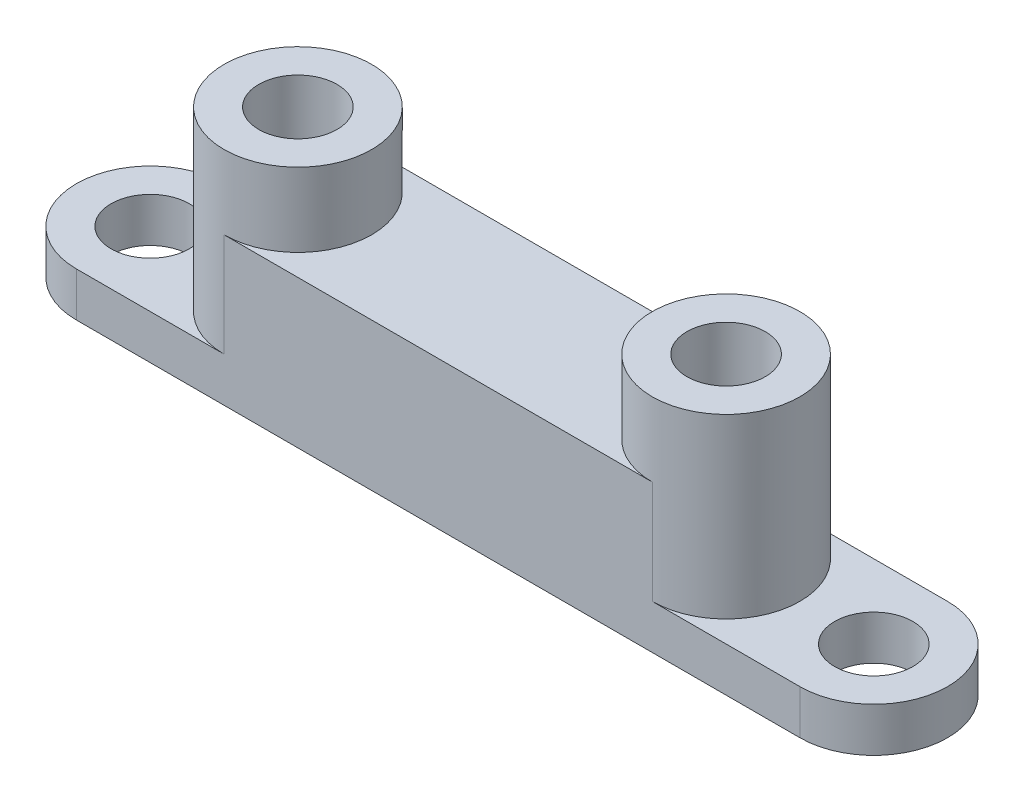
ISO-10303-21;
HEADER;
FILE_DESCRIPTION(('STEP AP214'),'2;1');
FILE_NAME('part.step','',(''),(''),'','','');
FILE_SCHEMA(('AUTOMOTIVE_DESIGN { 1 0 10303 214 1 1 1 1 }'));
ENDSEC;
DATA;
#1=APPLICATION_CONTEXT('core data for automotive mechanical design processes');
#2=APPLICATION_PROTOCOL_DEFINITION('international standard','automotive_design',2000,#1);
#3=PRODUCT_CONTEXT('',#1,'mechanical');
#4=PRODUCT('Part','Part','',(#3));
#5=PRODUCT_RELATED_PRODUCT_CATEGORY('part','',(#4));
#6=PRODUCT_DEFINITION_FORMATION('','',#4);
#7=PRODUCT_DEFINITION_CONTEXT('part definition',#1,'design');
#8=PRODUCT_DEFINITION('design','',#6,#7);
#9=PRODUCT_DEFINITION_SHAPE('','',#8);
#10=(LENGTH_UNIT() NAMED_UNIT(*) SI_UNIT(.MILLI.,.METRE.));
#11=(NAMED_UNIT(*) PLANE_ANGLE_UNIT() SI_UNIT($,.RADIAN.));
#12=(NAMED_UNIT(*) SI_UNIT($,.STERADIAN.) SOLID_ANGLE_UNIT());
#13=UNCERTAINTY_MEASURE_WITH_UNIT(LENGTH_MEASURE(1.E-05),#10,'distance_accuracy_value','');
#14=(GEOMETRIC_REPRESENTATION_CONTEXT(3) GLOBAL_UNCERTAINTY_ASSIGNED_CONTEXT((#13)) GLOBAL_UNIT_ASSIGNED_CONTEXT((#10,
#11,#12)) REPRESENTATION_CONTEXT('',''));
#15=CARTESIAN_POINT('',(0.,0.,0.));
#16=DIRECTION('',(0.,0.,1.));
#17=DIRECTION('',(1.,0.,0.));
#18=AXIS2_PLACEMENT_3D('',#15,#16,#17);
#19=CARTESIAN_POINT('',(34.0000000000001,15.,-5.));
#20=DIRECTION('',(0.,-1.,0.));
#21=DIRECTION('',(0.,0.,-1.));
#22=AXIS2_PLACEMENT_3D('',#19,#20,#21);
#23=CYLINDRICAL_SURFACE('',#22,5.);
#24=CARTESIAN_POINT('',(34.0000000000001,15.,-5.));
#25=DIRECTION('',(0.,1.,0.));
#26=DIRECTION('',(0.,0.,1.));
#27=AXIS2_PLACEMENT_3D('',#24,#25,#26);
#28=CIRCLE('',#27,5.);
#29=CARTESIAN_POINT('',(34.0000000000001,15.,0.));
#30=VERTEX_POINT('',#29);
#31=EDGE_CURVE('E165',#30,#30,#28,.T.);
#32=ORIENTED_EDGE('',*,*,#31,.F.);
#33=EDGE_LOOP('',(#32));
#34=FACE_BOUND('',#33,.T.);
#35=CARTESIAN_POINT('',(34.0000000000001,3.,-5.));
#36=DIRECTION('',(0.,-1.,0.));
#37=DIRECTION('',(0.,0.,-1.));
#38=AXIS2_PLACEMENT_3D('',#35,#36,#37);
#39=CIRCLE('',#38,5.);
#40=CARTESIAN_POINT('',(34.0000000000001,3.,-10.));
#41=VERTEX_POINT('',#40);
#42=CARTESIAN_POINT('',(34.0000000000001,3.,0.));
#43=VERTEX_POINT('',#42);
#44=EDGE_CURVE('E54',#41,#43,#39,.T.);
#45=ORIENTED_EDGE('',*,*,#44,.F.);
#46=DIRECTION('',(0.,-1.,0.));
#47=VECTOR('',#46,1.);
#48=CARTESIAN_POINT('',(34.0000000000001,15.,-10.));
#49=LINE('',#48,#47);
#50=CARTESIAN_POINT('',(34.0000000000001,10.,-10.));
#51=VERTEX_POINT('',#50);
#52=EDGE_CURVE('E43',#51,#41,#49,.T.);
#53=ORIENTED_EDGE('',*,*,#52,.F.);
#54=CARTESIAN_POINT('',(34.0000000000001,10.,-5.));
#55=DIRECTION('',(0.,-1.,0.));
#56=DIRECTION('',(0.,0.,1.));
#57=AXIS2_PLACEMENT_3D('',#54,#55,#56);
#58=CIRCLE('',#57,5.);
#59=CARTESIAN_POINT('',(34.0000000000001,10.,0.));
#60=VERTEX_POINT('',#59);
#61=EDGE_CURVE('E151',#60,#51,#58,.T.);
#62=ORIENTED_EDGE('',*,*,#61,.F.);
#63=DIRECTION('',(0.,-1.,0.));
#64=VECTOR('',#63,1.);
#65=CARTESIAN_POINT('',(34.0000000000001,15.,0.));
#66=LINE('',#65,#64);
#67=EDGE_CURVE('E50',#60,#43,#66,.T.);
#68=ORIENTED_EDGE('',*,*,#67,.T.);
#69=EDGE_LOOP('',(#45,#53,#62,#68));
#70=FACE_BOUND('',#69,.T.);
#71=ADVANCED_FACE('F36',(#34,#70),#23,.T.);
#72=CARTESIAN_POINT('',(5.00000000000012,15.,-5.));
#73=DIRECTION('',(0.,-1.,0.));
#74=DIRECTION('',(0.,0.,-1.));
#75=AXIS2_PLACEMENT_3D('',#72,#73,#74);
#76=CYLINDRICAL_SURFACE('',#75,5.);
#77=CARTESIAN_POINT('',(5.00000000000012,15.,-5.));
#78=DIRECTION('',(0.,1.,0.));
#79=DIRECTION('',(0.,0.,1.));
#80=AXIS2_PLACEMENT_3D('',#77,#78,#79);
#81=CIRCLE('',#80,5.);
#82=CARTESIAN_POINT('',(5.00000000000012,15.,0.));
#83=VERTEX_POINT('',#82);
#84=EDGE_CURVE('E168',#83,#83,#81,.T.);
#85=ORIENTED_EDGE('',*,*,#84,.F.);
#86=EDGE_LOOP('',(#85));
#87=FACE_BOUND('',#86,.T.);
#88=CARTESIAN_POINT('',(5.00000000000012,3.,-5.));
#89=DIRECTION('',(0.,-1.,0.));
#90=DIRECTION('',(0.,0.,-1.));
#91=AXIS2_PLACEMENT_3D('',#88,#89,#90);
#92=CIRCLE('',#91,5.);
#93=CARTESIAN_POINT('',(5.00000000000012,3.,0.));
#94=VERTEX_POINT('',#93);
#95=CARTESIAN_POINT('',(5.00000000000012,3.,-10.));
#96=VERTEX_POINT('',#95);
#97=EDGE_CURVE('E11',#94,#96,#92,.T.);
#98=ORIENTED_EDGE('',*,*,#97,.F.);
#99=DIRECTION('',(0.,-1.,0.));
#100=VECTOR('',#99,1.);
#101=CARTESIAN_POINT('',(5.00000000000012,15.,0.));
#102=LINE('',#101,#100);
#103=CARTESIAN_POINT('',(5.00000000000012,10.,0.));
#104=VERTEX_POINT('',#103);
#105=EDGE_CURVE('E174',#104,#94,#102,.T.);
#106=ORIENTED_EDGE('',*,*,#105,.F.);
#107=CARTESIAN_POINT('',(5.00000000000012,10.,-5.));
#108=DIRECTION('',(0.,-1.,0.));
#109=DIRECTION('',(0.,0.,1.));
#110=AXIS2_PLACEMENT_3D('',#107,#108,#109);
#111=CIRCLE('',#110,5.);
#112=CARTESIAN_POINT('',(5.00000000000012,10.,-10.));
#113=VERTEX_POINT('',#112);
#114=EDGE_CURVE('E146',#113,#104,#111,.T.);
#115=ORIENTED_EDGE('',*,*,#114,.F.);
#116=DIRECTION('',(0.,-1.,0.));
#117=VECTOR('',#116,1.);
#118=CARTESIAN_POINT('',(5.00000000000012,15.,-10.));
#119=LINE('',#118,#117);
#120=EDGE_CURVE('E177',#113,#96,#119,.T.);
#121=ORIENTED_EDGE('',*,*,#120,.T.);
#122=EDGE_LOOP('',(#98,#106,#115,#121));
#123=FACE_BOUND('',#122,.T.);
#124=ADVANCED_FACE('F202',(#87,#123),#76,.T.);
#125=CARTESIAN_POINT('',(34.0000000000001,15.,-5.));
#126=DIRECTION('',(0.,1.,0.));
#127=DIRECTION('',(0.,0.,1.));
#128=AXIS2_PLACEMENT_3D('',#125,#126,#127);
#129=PLANE('',#128);
#130=ORIENTED_EDGE('',*,*,#84,.T.);
#131=EDGE_LOOP('',(#130));
#132=FACE_BOUND('',#131,.T.);
#133=CARTESIAN_POINT('',(5.00000000000012,15.,-5.));
#134=DIRECTION('',(0.,1.,0.));
#135=DIRECTION('',(0.,0.,1.));
#136=AXIS2_PLACEMENT_3D('',#133,#134,#135);
#137=CIRCLE('',#136,2.65);
#138=CARTESIAN_POINT('',(5.00000000000012,15.,-2.35));
#139=VERTEX_POINT('',#138);
#140=EDGE_CURVE('E160',#139,#139,#137,.T.);
#141=ORIENTED_EDGE('',*,*,#140,.F.);
#142=EDGE_LOOP('',(#141));
#143=FACE_BOUND('',#142,.T.);
#144=ADVANCED_FACE('F207',(#132,#143),#129,.T.);
#145=CARTESIAN_POINT('',(5.00000000000012,15.,-10.));
#146=DIRECTION('',(0.,0.,1.));
#147=DIRECTION('',(1.,0.,0.));
#148=AXIS2_PLACEMENT_3D('',#145,#146,#147);
#149=PLANE('',#148);
#150=DIRECTION('',(-1.,0.,0.));
#151=VECTOR('',#150,1.);
#152=CARTESIAN_POINT('',(5.00000000000012,0.,-10.));
#153=LINE('',#152,#151);
#154=CARTESIAN_POINT('',(44.0018614213481,0.,-10.));
#155=VERTEX_POINT('',#154);
#156=CARTESIAN_POINT('',(-5.00186142134788,0.,-10.));
#157=VERTEX_POINT('',#156);
#158=EDGE_CURVE('E164',#155,#157,#153,.T.);
#159=ORIENTED_EDGE('',*,*,#158,.T.);
#160=DIRECTION('',(0.,-1.,0.));
#161=VECTOR('',#160,1.);
#162=CARTESIAN_POINT('',(-5.00186142134788,3.,-10.));
#163=LINE('',#162,#161);
#164=CARTESIAN_POINT('',(-5.00186142134788,3.,-10.));
#165=VERTEX_POINT('',#164);
#166=EDGE_CURVE('E141',#165,#157,#163,.T.);
#167=ORIENTED_EDGE('',*,*,#166,.F.);
#168=DIRECTION('',(1.,0.,0.));
#169=VECTOR('',#168,1.);
#170=CARTESIAN_POINT('',(44.0018614213481,3.,-10.));
#171=LINE('',#170,#169);
#172=EDGE_CURVE('E110',#165,#96,#171,.T.);
#173=ORIENTED_EDGE('',*,*,#172,.T.);
#174=ORIENTED_EDGE('',*,*,#120,.F.);
#175=DIRECTION('',(-1.,0.,0.));
#176=VECTOR('',#175,1.);
#177=CARTESIAN_POINT('',(5.00000000000012,10.,-10.));
#178=LINE('',#177,#176);
#179=EDGE_CURVE('E153',#51,#113,#178,.T.);
#180=ORIENTED_EDGE('',*,*,#179,.F.);
#181=ORIENTED_EDGE('',*,*,#52,.T.);
#182=CARTESIAN_POINT('',(44.0018614213481,3.,-10.));
#183=VERTEX_POINT('',#182);
#184=EDGE_CURVE('E135',#41,#183,#171,.T.);
#185=ORIENTED_EDGE('',*,*,#184,.T.);
#186=DIRECTION('',(0.,-1.,0.));
#187=VECTOR('',#186,1.);
#188=CARTESIAN_POINT('',(44.0018614213481,3.,-10.));
#189=LINE('',#188,#187);
#190=EDGE_CURVE('E123',#183,#155,#189,.T.);
#191=ORIENTED_EDGE('',*,*,#190,.T.);
#192=EDGE_LOOP('',(#159,#167,#173,#174,#180,#181,#185,#191));
#193=FACE_BOUND('',#192,.T.);
#194=ADVANCED_FACE('F227',(#193),#149,.F.);
#195=CARTESIAN_POINT('',(5.00000000000012,15.,0.));
#196=DIRECTION('',(0.,0.,-1.));
#197=DIRECTION('',(-1.,0.,0.));
#198=AXIS2_PLACEMENT_3D('',#195,#196,#197);
#199=PLANE('',#198);
#200=DIRECTION('',(1.,0.,0.));
#201=VECTOR('',#200,1.);
#202=CARTESIAN_POINT('',(5.00000000000012,0.,0.));
#203=LINE('',#202,#201);
#204=CARTESIAN_POINT('',(-5.00186142134788,0.,0.));
#205=VERTEX_POINT('',#204);
#206=CARTESIAN_POINT('',(44.0018614213481,0.,0.));
#207=VERTEX_POINT('',#206);
#208=EDGE_CURVE('E104',#205,#207,#203,.T.);
#209=ORIENTED_EDGE('',*,*,#208,.T.);
#210=DIRECTION('',(0.,-1.,0.));
#211=VECTOR('',#210,1.);
#212=CARTESIAN_POINT('',(44.0018614213481,3.,0.));
#213=LINE('',#212,#211);
#214=CARTESIAN_POINT('',(44.0018614213481,3.,0.));
#215=VERTEX_POINT('',#214);
#216=EDGE_CURVE('E99',#215,#207,#213,.T.);
#217=ORIENTED_EDGE('',*,*,#216,.F.);
#218=DIRECTION('',(-1.,0.,0.));
#219=VECTOR('',#218,1.);
#220=CARTESIAN_POINT('',(44.0018614213481,3.,0.));
#221=LINE('',#220,#219);
#222=EDGE_CURVE('E102',#215,#43,#221,.T.);
#223=ORIENTED_EDGE('',*,*,#222,.T.);
#224=ORIENTED_EDGE('',*,*,#67,.F.);
#225=DIRECTION('',(1.,0.,0.));
#226=VECTOR('',#225,1.);
#227=CARTESIAN_POINT('',(5.00000000000012,10.,0.));
#228=LINE('',#227,#226);
#229=EDGE_CURVE('E148',#104,#60,#228,.T.);
#230=ORIENTED_EDGE('',*,*,#229,.F.);
#231=ORIENTED_EDGE('',*,*,#105,.T.);
#232=CARTESIAN_POINT('',(-5.00186142134788,3.,0.));
#233=VERTEX_POINT('',#232);
#234=EDGE_CURVE('E118',#94,#233,#221,.T.);
#235=ORIENTED_EDGE('',*,*,#234,.T.);
#236=DIRECTION('',(0.,-1.,0.));
#237=VECTOR('',#236,1.);
#238=CARTESIAN_POINT('',(-5.00186142134788,3.,0.));
#239=LINE('',#238,#237);
#240=EDGE_CURVE('E109',#233,#205,#239,.T.);
#241=ORIENTED_EDGE('',*,*,#240,.T.);
#242=EDGE_LOOP('',(#209,#217,#223,#224,#230,#231,#235,#241));
#243=FACE_BOUND('',#242,.T.);
#244=ADVANCED_FACE('F101',(#243),#199,.F.);
#245=CARTESIAN_POINT('',(34.0000000000001,15.,-5.));
#246=DIRECTION('',(0.,-1.,0.));
#247=DIRECTION('',(0.,0.,-1.));
#248=AXIS2_PLACEMENT_3D('',#245,#246,#247);
#249=CYLINDRICAL_SURFACE('',#248,2.65);
#250=CARTESIAN_POINT('',(34.0000000000001,15.,-5.));
#251=DIRECTION('',(0.,1.,0.));
#252=DIRECTION('',(0.,0.,1.));
#253=AXIS2_PLACEMENT_3D('',#250,#251,#252);
#254=CIRCLE('',#253,2.65);
#255=CARTESIAN_POINT('',(34.0000000000001,15.,-2.35));
#256=VERTEX_POINT('',#255);
#257=EDGE_CURVE('E157',#256,#256,#254,.T.);
#258=ORIENTED_EDGE('',*,*,#257,.T.);
#259=EDGE_LOOP('',(#258));
#260=FACE_BOUND('',#259,.T.);
#261=CARTESIAN_POINT('',(34.0000000000001,4.,-5.));
#262=DIRECTION('',(0.,-1.,0.));
#263=DIRECTION('',(0.,0.,-1.));
#264=AXIS2_PLACEMENT_3D('',#261,#262,#263);
#265=CIRCLE('',#264,2.65);
#266=CARTESIAN_POINT('',(34.0000000000001,4.,-7.65));
#267=VERTEX_POINT('',#266);
#268=EDGE_CURVE('E156',#267,#267,#265,.T.);
#269=ORIENTED_EDGE('',*,*,#268,.T.);
#270=EDGE_LOOP('',(#269));
#271=FACE_BOUND('',#270,.T.);
#272=ADVANCED_FACE('F184',(#260,#271),#249,.F.);
#273=CARTESIAN_POINT('',(5.00000000000012,15.,-5.));
#274=DIRECTION('',(0.,-1.,0.));
#275=DIRECTION('',(0.,0.,-1.));
#276=AXIS2_PLACEMENT_3D('',#273,#274,#275);
#277=CYLINDRICAL_SURFACE('',#276,2.65);
#278=ORIENTED_EDGE('',*,*,#140,.T.);
#279=EDGE_LOOP('',(#278));
#280=FACE_BOUND('',#279,.T.);
#281=CARTESIAN_POINT('',(5.00000000000012,4.,-5.));
#282=DIRECTION('',(0.,-1.,0.));
#283=DIRECTION('',(0.,0.,-1.));
#284=AXIS2_PLACEMENT_3D('',#281,#282,#283);
#285=CIRCLE('',#284,2.65);
#286=CARTESIAN_POINT('',(5.00000000000012,4.,-7.65));
#287=VERTEX_POINT('',#286);
#288=EDGE_CURVE('E161',#287,#287,#285,.T.);
#289=ORIENTED_EDGE('',*,*,#288,.T.);
#290=EDGE_LOOP('',(#289));
#291=FACE_BOUND('',#290,.T.);
#292=ADVANCED_FACE('F215',(#280,#291),#277,.F.);
#293=ORIENTED_EDGE('',*,*,#31,.T.);
#294=EDGE_LOOP('',(#293));
#295=FACE_BOUND('',#294,.T.);
#296=ORIENTED_EDGE('',*,*,#257,.F.);
#297=EDGE_LOOP('',(#296));
#298=FACE_BOUND('',#297,.T.);
#299=ADVANCED_FACE('F212',(#295,#298),#129,.T.);
#300=CARTESIAN_POINT('',(34.0000000000001,0.,-5.));
#301=DIRECTION('',(0.,1.,0.));
#302=DIRECTION('',(0.,0.,1.));
#303=AXIS2_PLACEMENT_3D('',#300,#301,#302);
#304=PLANE('',#303);
#305=ORIENTED_EDGE('',*,*,#158,.F.);
#306=CARTESIAN_POINT('',(44.0018614213481,0.,-5.));
#307=DIRECTION('',(0.,-1.,0.));
#308=DIRECTION('',(0.,0.,-1.));
#309=AXIS2_PLACEMENT_3D('',#306,#307,#308);
#310=CIRCLE('',#309,5.);
#311=EDGE_CURVE('E127',#155,#207,#310,.T.);
#312=ORIENTED_EDGE('',*,*,#311,.T.);
#313=ORIENTED_EDGE('',*,*,#208,.F.);
#314=CARTESIAN_POINT('',(-5.00186142134788,0.,-5.));
#315=DIRECTION('',(0.,-1.,0.));
#316=DIRECTION('',(0.,0.,-1.));
#317=AXIS2_PLACEMENT_3D('',#314,#315,#316);
#318=CIRCLE('',#317,5.);
#319=EDGE_CURVE('E124',#205,#157,#318,.T.);
#320=ORIENTED_EDGE('',*,*,#319,.T.);
#321=EDGE_LOOP('',(#305,#312,#313,#320));
#322=FACE_BOUND('',#321,.T.);
#323=CARTESIAN_POINT('',(-5.00186142134788,0.,-5.));
#324=DIRECTION('',(0.,-1.,0.));
#325=DIRECTION('',(0.,0.,-1.));
#326=AXIS2_PLACEMENT_3D('',#323,#324,#325);
#327=CIRCLE('',#326,2.65);
#328=CARTESIAN_POINT('',(-5.00186142134788,0.,-7.65));
#329=VERTEX_POINT('',#328);
#330=EDGE_CURVE('E130',#329,#329,#327,.T.);
#331=ORIENTED_EDGE('',*,*,#330,.F.);
#332=EDGE_LOOP('',(#331));
#333=FACE_BOUND('',#332,.T.);
#334=CARTESIAN_POINT('',(44.0018614213481,0.,-5.));
#335=DIRECTION('',(0.,-1.,0.));
#336=DIRECTION('',(0.,0.,-1.));
#337=AXIS2_PLACEMENT_3D('',#334,#335,#336);
#338=CIRCLE('',#337,2.65000000000001);
#339=CARTESIAN_POINT('',(44.0018614213481,0.,-7.65000000000001));
#340=VERTEX_POINT('',#339);
#341=EDGE_CURVE('E280',#340,#340,#338,.T.);
#342=ORIENTED_EDGE('',*,*,#341,.F.);
#343=EDGE_LOOP('',(#342));
#344=FACE_BOUND('',#343,.T.);
#345=ADVANCED_FACE('F198',(#322,#333,#344),#304,.F.);
#346=CARTESIAN_POINT('',(5.00000000000012,4.,-5.));
#347=DIRECTION('',(0.,-1.,0.));
#348=DIRECTION('',(0.,0.,-1.));
#349=AXIS2_PLACEMENT_3D('',#346,#347,#348);
#350=PLANE('',#349);
#351=ORIENTED_EDGE('',*,*,#288,.F.);
#352=EDGE_LOOP('',(#351));
#353=FACE_BOUND('',#352,.T.);
#354=ADVANCED_FACE('F189',(#353),#350,.F.);
#355=CARTESIAN_POINT('',(34.0000000000001,4.,-5.));
#356=DIRECTION('',(0.,-1.,0.));
#357=DIRECTION('',(0.,0.,-1.));
#358=AXIS2_PLACEMENT_3D('',#355,#356,#357);
#359=PLANE('',#358);
#360=ORIENTED_EDGE('',*,*,#268,.F.);
#361=EDGE_LOOP('',(#360));
#362=FACE_BOUND('',#361,.T.);
#363=ADVANCED_FACE('F186',(#362),#359,.F.);
#364=CARTESIAN_POINT('',(5.00000000000012,10.,-5.));
#365=DIRECTION('',(0.,1.,0.));
#366=DIRECTION('',(0.,0.,1.));
#367=AXIS2_PLACEMENT_3D('',#364,#365,#366);
#368=PLANE('',#367);
#369=ORIENTED_EDGE('',*,*,#114,.T.);
#370=ORIENTED_EDGE('',*,*,#229,.T.);
#371=ORIENTED_EDGE('',*,*,#61,.T.);
#372=ORIENTED_EDGE('',*,*,#179,.T.);
#373=EDGE_LOOP('',(#369,#370,#371,#372));
#374=FACE_BOUND('',#373,.T.);
#375=ADVANCED_FACE('F188',(#374),#368,.T.);
#376=CARTESIAN_POINT('',(-5.00186142134788,3.,-5.));
#377=DIRECTION('',(0.,-1.,0.));
#378=DIRECTION('',(0.,0.,-1.));
#379=AXIS2_PLACEMENT_3D('',#376,#377,#378);
#380=CYLINDRICAL_SURFACE('',#379,2.65);
#381=CARTESIAN_POINT('',(-5.00186142134788,3.,-5.));
#382=DIRECTION('',(0.,-1.,0.));
#383=DIRECTION('',(0.,0.,-1.));
#384=AXIS2_PLACEMENT_3D('',#381,#382,#383);
#385=CIRCLE('',#384,2.65);
#386=CARTESIAN_POINT('',(-5.00186142134788,3.,-7.65));
#387=VERTEX_POINT('',#386);
#388=EDGE_CURVE('E138',#387,#387,#385,.T.);
#389=ORIENTED_EDGE('',*,*,#388,.F.);
#390=EDGE_LOOP('',(#389));
#391=FACE_BOUND('',#390,.T.);
#392=ORIENTED_EDGE('',*,*,#330,.T.);
#393=EDGE_LOOP('',(#392));
#394=FACE_BOUND('',#393,.T.);
#395=ADVANCED_FACE('F195',(#391,#394),#380,.F.);
#396=CARTESIAN_POINT('',(-5.00186142134788,3.,-5.));
#397=DIRECTION('',(0.,-1.,0.));
#398=DIRECTION('',(0.,0.,-1.));
#399=AXIS2_PLACEMENT_3D('',#396,#397,#398);
#400=CYLINDRICAL_SURFACE('',#399,5.);
#401=ORIENTED_EDGE('',*,*,#319,.F.);
#402=ORIENTED_EDGE('',*,*,#240,.F.);
#403=CARTESIAN_POINT('',(-5.00186142134788,3.,-5.));
#404=DIRECTION('',(0.,-1.,0.));
#405=DIRECTION('',(0.,0.,-1.));
#406=AXIS2_PLACEMENT_3D('',#403,#404,#405);
#407=CIRCLE('',#406,5.);
#408=EDGE_CURVE('E117',#233,#165,#407,.T.);
#409=ORIENTED_EDGE('',*,*,#408,.T.);
#410=ORIENTED_EDGE('',*,*,#166,.T.);
#411=EDGE_LOOP('',(#401,#402,#409,#410));
#412=FACE_BOUND('',#411,.T.);
#413=ADVANCED_FACE('F240',(#412),#400,.T.);
#414=CARTESIAN_POINT('',(44.0018614213481,3.,-5.));
#415=DIRECTION('',(0.,-1.,0.));
#416=DIRECTION('',(0.,0.,-1.));
#417=AXIS2_PLACEMENT_3D('',#414,#415,#416);
#418=PLANE('',#417);
#419=ORIENTED_EDGE('',*,*,#388,.T.);
#420=EDGE_LOOP('',(#419));
#421=FACE_BOUND('',#420,.T.);
#422=ORIENTED_EDGE('',*,*,#234,.F.);
#423=ORIENTED_EDGE('',*,*,#97,.T.);
#424=ORIENTED_EDGE('',*,*,#172,.F.);
#425=ORIENTED_EDGE('',*,*,#408,.F.);
#426=EDGE_LOOP('',(#422,#423,#424,#425));
#427=FACE_BOUND('',#426,.T.);
#428=ADVANCED_FACE('F247',(#421,#427),#418,.F.);
#429=CARTESIAN_POINT('',(44.0018614213481,3.,-5.));
#430=DIRECTION('',(0.,-1.,0.));
#431=DIRECTION('',(0.,0.,-1.));
#432=AXIS2_PLACEMENT_3D('',#429,#430,#431);
#433=CIRCLE('',#432,2.65000000000001);
#434=CARTESIAN_POINT('',(44.0018614213481,3.,-7.65000000000001));
#435=VERTEX_POINT('',#434);
#436=EDGE_CURVE('E277',#435,#435,#433,.T.);
#437=ORIENTED_EDGE('',*,*,#436,.T.);
#438=EDGE_LOOP('',(#437));
#439=FACE_BOUND('',#438,.T.);
#440=ORIENTED_EDGE('',*,*,#184,.F.);
#441=ORIENTED_EDGE('',*,*,#44,.T.);
#442=ORIENTED_EDGE('',*,*,#222,.F.);
#443=CARTESIAN_POINT('',(44.0018614213481,3.,-5.));
#444=DIRECTION('',(0.,-1.,0.));
#445=DIRECTION('',(0.,0.,-1.));
#446=AXIS2_PLACEMENT_3D('',#443,#444,#445);
#447=CIRCLE('',#446,5.);
#448=EDGE_CURVE('E116',#183,#215,#447,.T.);
#449=ORIENTED_EDGE('',*,*,#448,.F.);
#450=EDGE_LOOP('',(#440,#441,#442,#449));
#451=FACE_BOUND('',#450,.T.);
#452=ADVANCED_FACE('F115',(#439,#451),#418,.F.);
#453=CARTESIAN_POINT('',(44.0018614213481,3.,-5.));
#454=DIRECTION('',(0.,-1.,0.));
#455=DIRECTION('',(0.,0.,-1.));
#456=AXIS2_PLACEMENT_3D('',#453,#454,#455);
#457=CYLINDRICAL_SURFACE('',#456,5.);
#458=ORIENTED_EDGE('',*,*,#311,.F.);
#459=ORIENTED_EDGE('',*,*,#190,.F.);
#460=ORIENTED_EDGE('',*,*,#448,.T.);
#461=ORIENTED_EDGE('',*,*,#216,.T.);
#462=EDGE_LOOP('',(#458,#459,#460,#461));
#463=FACE_BOUND('',#462,.T.);
#464=ADVANCED_FACE('F121',(#463),#457,.T.);
#465=CARTESIAN_POINT('',(44.0018614213481,3.,-5.));
#466=DIRECTION('',(0.,-1.,0.));
#467=DIRECTION('',(0.,0.,-1.));
#468=AXIS2_PLACEMENT_3D('',#465,#466,#467);
#469=CYLINDRICAL_SURFACE('',#468,2.65000000000001);
#470=ORIENTED_EDGE('',*,*,#436,.F.);
#471=EDGE_LOOP('',(#470));
#472=FACE_BOUND('',#471,.T.);
#473=ORIENTED_EDGE('',*,*,#341,.T.);
#474=EDGE_LOOP('',(#473));
#475=FACE_BOUND('',#474,.T.);
#476=ADVANCED_FACE('F267',(#472,#475),#469,.F.);
#477=CLOSED_SHELL('',(#71,#124,#144,#194,#244,#272,#292,#299,#345,#354,#363,#375,#395,#413,#428,
#452,#464,#476));
#478=MANIFOLD_SOLID_BREP('B2',#477);
#479=ADVANCED_BREP_SHAPE_REPRESENTATION('',(#18,#478),#14);
#480=SHAPE_DEFINITION_REPRESENTATION(#9,#479);
ENDSEC;
END-ISO-10303-21;
